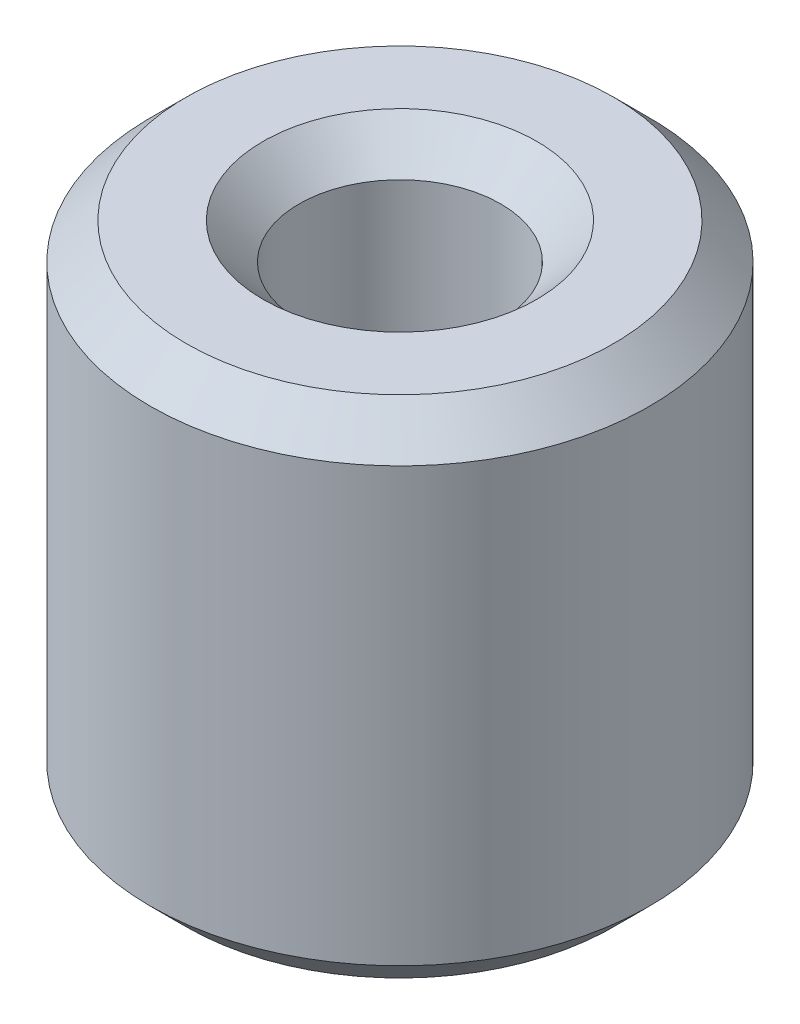
ISO-10303-21;
HEADER;
FILE_DESCRIPTION(('STEP AP214'),'2;1');
FILE_NAME('part.step','',(''),(''),'','','');
FILE_SCHEMA(('AUTOMOTIVE_DESIGN { 1 0 10303 214 1 1 1 1 }'));
ENDSEC;
DATA;
#1=APPLICATION_CONTEXT('core data for automotive mechanical design processes');
#2=APPLICATION_PROTOCOL_DEFINITION('international standard','automotive_design',2000,#1);
#3=PRODUCT_CONTEXT('',#1,'mechanical');
#4=PRODUCT('Part','Part','',(#3));
#5=PRODUCT_RELATED_PRODUCT_CATEGORY('part','',(#4));
#6=PRODUCT_DEFINITION_FORMATION('','',#4);
#7=PRODUCT_DEFINITION_CONTEXT('part definition',#1,'design');
#8=PRODUCT_DEFINITION('design','',#6,#7);
#9=PRODUCT_DEFINITION_SHAPE('','',#8);
#10=(LENGTH_UNIT() NAMED_UNIT(*) SI_UNIT(.MILLI.,.METRE.));
#11=(NAMED_UNIT(*) PLANE_ANGLE_UNIT() SI_UNIT($,.RADIAN.));
#12=(NAMED_UNIT(*) SI_UNIT($,.STERADIAN.) SOLID_ANGLE_UNIT());
#13=UNCERTAINTY_MEASURE_WITH_UNIT(LENGTH_MEASURE(1.E-05),#10,'distance_accuracy_value','');
#14=(GEOMETRIC_REPRESENTATION_CONTEXT(3) GLOBAL_UNCERTAINTY_ASSIGNED_CONTEXT((#13)) GLOBAL_UNIT_ASSIGNED_CONTEXT((#10,
#11,#12)) REPRESENTATION_CONTEXT('',''));
#15=CARTESIAN_POINT('',(0.,0.,0.));
#16=DIRECTION('',(0.,0.,1.));
#17=DIRECTION('',(1.,0.,0.));
#18=AXIS2_PLACEMENT_3D('',#15,#16,#17);
#19=CARTESIAN_POINT('',(0.,55.62915017058,0.));
#20=DIRECTION('',(0.,-1.,0.));
#21=DIRECTION('',(0.,0.,-1.));
#22=AXIS2_PLACEMENT_3D('',#19,#20,#21);
#23=CYLINDRICAL_SURFACE('',#22,27.5);
#24=CARTESIAN_POINT('',(0.,3.97547857271617,0.));
#25=DIRECTION('',(0.,1.,0.));
#26=DIRECTION('',(0.,0.,1.));
#27=AXIS2_PLACEMENT_3D('',#24,#25,#26);
#28=CIRCLE('',#27,27.5);
#29=CARTESIAN_POINT('',(0.,3.97547857271617,27.5));
#30=VERTEX_POINT('',#29);
#31=EDGE_CURVE('E10',#30,#30,#28,.T.);
#32=ORIENTED_EDGE('',*,*,#31,.T.);
#33=EDGE_LOOP('',(#32));
#34=FACE_BOUND('',#33,.T.);
#35=CARTESIAN_POINT('',(0.,51.6536715978638,0.));
#36=DIRECTION('',(0.,1.,0.));
#37=DIRECTION('',(0.,0.,1.));
#38=AXIS2_PLACEMENT_3D('',#35,#36,#37);
#39=CIRCLE('',#38,27.5);
#40=CARTESIAN_POINT('',(0.,51.6536715978638,27.5));
#41=VERTEX_POINT('',#40);
#42=EDGE_CURVE('E50',#41,#41,#39,.F.);
#43=ORIENTED_EDGE('',*,*,#42,.T.);
#44=EDGE_LOOP('',(#43));
#45=FACE_BOUND('',#44,.T.);
#46=ADVANCED_FACE('F39',(#34,#45),#23,.T.);
#47=CARTESIAN_POINT('',(0.,55.62915017058,0.));
#48=DIRECTION('',(0.,1.,0.));
#49=DIRECTION('',(0.,0.,1.));
#50=AXIS2_PLACEMENT_3D('',#47,#48,#49);
#51=PLANE('',#50);
#52=CARTESIAN_POINT('',(0.,55.62915017058,0.));
#53=DIRECTION('',(0.,1.,0.));
#54=DIRECTION('',(0.,0.,1.));
#55=AXIS2_PLACEMENT_3D('',#52,#53,#54);
#56=CIRCLE('',#55,15.0788469635004);
#57=CARTESIAN_POINT('',(0.,55.62915017058,15.0788469635004));
#58=VERTEX_POINT('',#57);
#59=EDGE_CURVE('E58',#58,#58,#56,.F.);
#60=ORIENTED_EDGE('',*,*,#59,.T.);
#61=EDGE_LOOP('',(#60));
#62=FACE_BOUND('',#61,.T.);
#63=CARTESIAN_POINT('',(0.,55.62915017058,0.));
#64=DIRECTION('',(0.,1.,0.));
#65=DIRECTION('',(0.,0.,1.));
#66=AXIS2_PLACEMENT_3D('',#63,#64,#65);
#67=CIRCLE('',#66,23.5245214272838);
#68=CARTESIAN_POINT('',(0.,55.62915017058,23.5245214272838));
#69=VERTEX_POINT('',#68);
#70=EDGE_CURVE('E61',#69,#69,#67,.T.);
#71=ORIENTED_EDGE('',*,*,#70,.T.);
#72=EDGE_LOOP('',(#71));
#73=FACE_BOUND('',#72,.T.);
#74=ADVANCED_FACE('F88',(#62,#73),#51,.T.);
#75=CARTESIAN_POINT('',(0.,0.,0.));
#76=DIRECTION('',(0.,1.,0.));
#77=DIRECTION('',(0.,0.,1.));
#78=AXIS2_PLACEMENT_3D('',#75,#76,#77);
#79=PLANE('',#78);
#80=CARTESIAN_POINT('',(0.,0.,0.));
#81=DIRECTION('',(0.,1.,0.));
#82=DIRECTION('',(0.,0.,1.));
#83=AXIS2_PLACEMENT_3D('',#80,#81,#82);
#84=CIRCLE('',#83,15.0788469635004);
#85=CARTESIAN_POINT('',(0.,0.,15.0788469635004));
#86=VERTEX_POINT('',#85);
#87=EDGE_CURVE('E51',#86,#86,#84,.T.);
#88=ORIENTED_EDGE('',*,*,#87,.T.);
#89=EDGE_LOOP('',(#88));
#90=FACE_BOUND('',#89,.T.);
#91=CARTESIAN_POINT('',(0.,0.,0.));
#92=DIRECTION('',(0.,1.,0.));
#93=DIRECTION('',(0.,0.,1.));
#94=AXIS2_PLACEMENT_3D('',#91,#92,#93);
#95=CIRCLE('',#94,23.5245214272838);
#96=CARTESIAN_POINT('',(0.,0.,23.5245214272838));
#97=VERTEX_POINT('',#96);
#98=EDGE_CURVE('E54',#97,#97,#95,.F.);
#99=ORIENTED_EDGE('',*,*,#98,.T.);
#100=EDGE_LOOP('',(#99));
#101=FACE_BOUND('',#100,.T.);
#102=ADVANCED_FACE('F83',(#90,#101),#79,.F.);
#103=CARTESIAN_POINT('',(0.,55.62915017058,0.));
#104=DIRECTION('',(0.,-1.,0.));
#105=DIRECTION('',(0.,0.,-1.));
#106=AXIS2_PLACEMENT_3D('',#103,#104,#105);
#107=CYLINDRICAL_SURFACE('',#106,11.1033683907842);
#108=CARTESIAN_POINT('',(0.,51.6536715978638,0.));
#109=DIRECTION('',(0.,1.,0.));
#110=DIRECTION('',(0.,0.,1.));
#111=AXIS2_PLACEMENT_3D('',#108,#109,#110);
#112=CIRCLE('',#111,11.1033683907842);
#113=CARTESIAN_POINT('',(0.,51.6536715978638,11.1033683907842));
#114=VERTEX_POINT('',#113);
#115=EDGE_CURVE('E67',#114,#114,#112,.T.);
#116=ORIENTED_EDGE('',*,*,#115,.T.);
#117=EDGE_LOOP('',(#116));
#118=FACE_BOUND('',#117,.T.);
#119=CARTESIAN_POINT('',(0.,3.97547857271621,0.));
#120=DIRECTION('',(0.,1.,0.));
#121=DIRECTION('',(0.,0.,1.));
#122=AXIS2_PLACEMENT_3D('',#119,#120,#121);
#123=CIRCLE('',#122,11.1033683907842);
#124=CARTESIAN_POINT('',(0.,3.97547857271621,11.1033683907842));
#125=VERTEX_POINT('',#124);
#126=EDGE_CURVE('E69',#125,#125,#123,.F.);
#127=ORIENTED_EDGE('',*,*,#126,.T.);
#128=EDGE_LOOP('',(#127));
#129=FACE_BOUND('',#128,.T.);
#130=ADVANCED_FACE('F71',(#118,#129),#107,.F.);
#131=CARTESIAN_POINT('',(0.,51.6536715978638,0.));
#132=DIRECTION('',(0.,1.,0.));
#133=DIRECTION('',(0.,0.,1.));
#134=AXIS2_PLACEMENT_3D('',#131,#132,#133);
#135=CONICAL_SURFACE('',#134,11.1033683907842,0.785398163397451);
#136=ORIENTED_EDGE('',*,*,#59,.F.);
#137=EDGE_LOOP('',(#136));
#138=FACE_BOUND('',#137,.T.);
#139=ORIENTED_EDGE('',*,*,#115,.F.);
#140=EDGE_LOOP('',(#139));
#141=FACE_BOUND('',#140,.T.);
#142=ADVANCED_FACE('F77',(#138,#141),#135,.F.);
#143=CARTESIAN_POINT('',(0.,0.,0.));
#144=DIRECTION('',(0.,-1.,0.));
#145=DIRECTION('',(0.,0.,-1.));
#146=AXIS2_PLACEMENT_3D('',#143,#144,#145);
#147=CONICAL_SURFACE('',#146,15.0788469635004,0.785398163397446);
#148=ORIENTED_EDGE('',*,*,#126,.F.);
#149=EDGE_LOOP('',(#148));
#150=FACE_BOUND('',#149,.T.);
#151=ORIENTED_EDGE('',*,*,#87,.F.);
#152=EDGE_LOOP('',(#151));
#153=FACE_BOUND('',#152,.T.);
#154=ADVANCED_FACE('F73',(#150,#153),#147,.F.);
#155=CARTESIAN_POINT('',(0.,3.97547857271617,0.));
#156=DIRECTION('',(0.,1.,0.));
#157=DIRECTION('',(0.,0.,1.));
#158=AXIS2_PLACEMENT_3D('',#155,#156,#157);
#159=CONICAL_SURFACE('',#158,27.5,0.785398163397451);
#160=ORIENTED_EDGE('',*,*,#98,.F.);
#161=EDGE_LOOP('',(#160));
#162=FACE_BOUND('',#161,.T.);
#163=ORIENTED_EDGE('',*,*,#31,.F.);
#164=EDGE_LOOP('',(#163));
#165=FACE_BOUND('',#164,.T.);
#166=ADVANCED_FACE('F76',(#162,#165),#159,.T.);
#167=CARTESIAN_POINT('',(0.,55.62915017058,0.));
#168=DIRECTION('',(0.,-1.,0.));
#169=DIRECTION('',(0.,0.,-1.));
#170=AXIS2_PLACEMENT_3D('',#167,#168,#169);
#171=CONICAL_SURFACE('',#170,23.5245214272838,0.785398163397444);
#172=ORIENTED_EDGE('',*,*,#42,.F.);
#173=EDGE_LOOP('',(#172));
#174=FACE_BOUND('',#173,.T.);
#175=ORIENTED_EDGE('',*,*,#70,.F.);
#176=EDGE_LOOP('',(#175));
#177=FACE_BOUND('',#176,.T.);
#178=ADVANCED_FACE('F45',(#174,#177),#171,.T.);
#179=CLOSED_SHELL('',(#46,#74,#102,#130,#142,#154,#166,#178));
#180=MANIFOLD_SOLID_BREP('B2',#179);
#181=ADVANCED_BREP_SHAPE_REPRESENTATION('',(#18,#180),#14);
#182=SHAPE_DEFINITION_REPRESENTATION(#9,#181);
ENDSEC;
END-ISO-10303-21;
